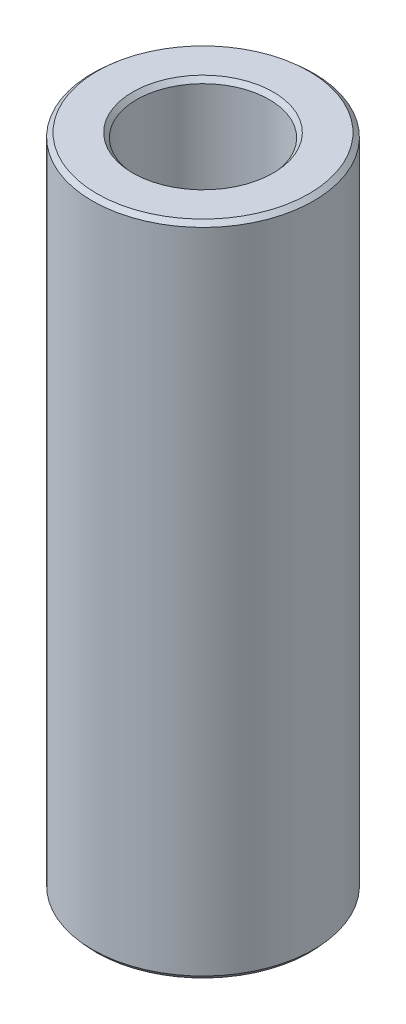
ISO-10303-21;
HEADER;
FILE_DESCRIPTION(('STEP AP214'),'2;1');
FILE_NAME('part.step','',(''),(''),'','','');
FILE_SCHEMA(('AUTOMOTIVE_DESIGN { 1 0 10303 214 1 1 1 1 }'));
ENDSEC;
DATA;
#1=APPLICATION_CONTEXT('core data for automotive mechanical design processes');
#2=APPLICATION_PROTOCOL_DEFINITION('international standard','automotive_design',2000,#1);
#3=PRODUCT_CONTEXT('',#1,'mechanical');
#4=PRODUCT('Part','Part','',(#3));
#5=PRODUCT_RELATED_PRODUCT_CATEGORY('part','',(#4));
#6=PRODUCT_DEFINITION_FORMATION('','',#4);
#7=PRODUCT_DEFINITION_CONTEXT('part definition',#1,'design');
#8=PRODUCT_DEFINITION('design','',#6,#7);
#9=PRODUCT_DEFINITION_SHAPE('','',#8);
#10=(LENGTH_UNIT() NAMED_UNIT(*) SI_UNIT(.MILLI.,.METRE.));
#11=(NAMED_UNIT(*) PLANE_ANGLE_UNIT() SI_UNIT($,.RADIAN.));
#12=(NAMED_UNIT(*) SI_UNIT($,.STERADIAN.) SOLID_ANGLE_UNIT());
#13=UNCERTAINTY_MEASURE_WITH_UNIT(LENGTH_MEASURE(1.E-05),#10,'distance_accuracy_value','');
#14=(GEOMETRIC_REPRESENTATION_CONTEXT(3) GLOBAL_UNCERTAINTY_ASSIGNED_CONTEXT((#13)) GLOBAL_UNIT_ASSIGNED_CONTEXT((#10,
#11,#12)) REPRESENTATION_CONTEXT('',''));
#15=CARTESIAN_POINT('',(0.,0.,0.));
#16=DIRECTION('',(0.,0.,1.));
#17=DIRECTION('',(1.,0.,0.));
#18=AXIS2_PLACEMENT_3D('',#15,#16,#17);
#19=CARTESIAN_POINT('',(0.,222.663709107009,0.));
#20=DIRECTION('',(0.,-1.,0.));
#21=DIRECTION('',(0.,0.,-1.));
#22=AXIS2_PLACEMENT_3D('',#19,#20,#21);
#23=CYLINDRICAL_SURFACE('',#22,37.5);
#24=CARTESIAN_POINT('',(0.,1.54506630797216,0.));
#25=DIRECTION('',(0.,1.,0.));
#26=DIRECTION('',(0.,0.,1.));
#27=AXIS2_PLACEMENT_3D('',#24,#25,#26);
#28=CIRCLE('',#27,37.5);
#29=CARTESIAN_POINT('',(0.,1.54506630797216,37.5));
#30=VERTEX_POINT('',#29);
#31=EDGE_CURVE('E10',#30,#30,#28,.T.);
#32=ORIENTED_EDGE('',*,*,#31,.T.);
#33=EDGE_LOOP('',(#32));
#34=FACE_BOUND('',#33,.T.);
#35=CARTESIAN_POINT('',(0.,221.30656046984,0.));
#36=DIRECTION('',(0.,1.,0.));
#37=DIRECTION('',(0.,0.,1.));
#38=AXIS2_PLACEMENT_3D('',#35,#36,#37);
#39=CIRCLE('',#38,37.5);
#40=CARTESIAN_POINT('',(0.,221.30656046984,37.5));
#41=VERTEX_POINT('',#40);
#42=EDGE_CURVE('E50',#41,#41,#39,.F.);
#43=ORIENTED_EDGE('',*,*,#42,.T.);
#44=EDGE_LOOP('',(#43));
#45=FACE_BOUND('',#44,.T.);
#46=ADVANCED_FACE('F39',(#34,#45),#23,.T.);
#47=CARTESIAN_POINT('',(0.,222.663709107009,0.));
#48=DIRECTION('',(0.,1.,0.));
#49=DIRECTION('',(0.,0.,1.));
#50=AXIS2_PLACEMENT_3D('',#47,#48,#49);
#51=PLANE('',#50);
#52=CARTESIAN_POINT('',(0.,222.663709107009,0.));
#53=DIRECTION('',(0.,1.,0.));
#54=DIRECTION('',(0.,0.,1.));
#55=AXIS2_PLACEMENT_3D('',#52,#53,#54);
#56=CIRCLE('',#55,23.8172264737195);
#57=CARTESIAN_POINT('',(0.,222.663709107009,23.8172264737195));
#58=VERTEX_POINT('',#57);
#59=EDGE_CURVE('E58',#58,#58,#56,.F.);
#60=ORIENTED_EDGE('',*,*,#59,.T.);
#61=EDGE_LOOP('',(#60));
#62=FACE_BOUND('',#61,.T.);
#63=CARTESIAN_POINT('',(0.,222.663709107009,0.));
#64=DIRECTION('',(0.,1.,0.));
#65=DIRECTION('',(0.,0.,1.));
#66=AXIS2_PLACEMENT_3D('',#63,#64,#65);
#67=CIRCLE('',#66,35.9549336920279);
#68=CARTESIAN_POINT('',(0.,222.663709107009,35.9549336920279));
#69=VERTEX_POINT('',#68);
#70=EDGE_CURVE('E61',#69,#69,#67,.T.);
#71=ORIENTED_EDGE('',*,*,#70,.T.);
#72=EDGE_LOOP('',(#71));
#73=FACE_BOUND('',#72,.T.);
#74=ADVANCED_FACE('F88',(#62,#73),#51,.T.);
#75=CARTESIAN_POINT('',(0.,0.,0.));
#76=DIRECTION('',(0.,1.,0.));
#77=DIRECTION('',(0.,0.,1.));
#78=AXIS2_PLACEMENT_3D('',#75,#76,#77);
#79=PLANE('',#78);
#80=CARTESIAN_POINT('',(0.,0.,0.));
#81=DIRECTION('',(0.,1.,0.));
#82=DIRECTION('',(0.,0.,1.));
#83=AXIS2_PLACEMENT_3D('',#80,#81,#82);
#84=CIRCLE('',#83,24.0051441445224);
#85=CARTESIAN_POINT('',(0.,0.,24.0051441445224));
#86=VERTEX_POINT('',#85);
#87=EDGE_CURVE('E51',#86,#86,#84,.T.);
#88=ORIENTED_EDGE('',*,*,#87,.T.);
#89=EDGE_LOOP('',(#88));
#90=FACE_BOUND('',#89,.T.);
#91=CARTESIAN_POINT('',(0.,0.,0.));
#92=DIRECTION('',(0.,1.,0.));
#93=DIRECTION('',(0.,0.,1.));
#94=AXIS2_PLACEMENT_3D('',#91,#92,#93);
#95=CIRCLE('',#94,36.1428513628309);
#96=CARTESIAN_POINT('',(0.,0.,36.1428513628309));
#97=VERTEX_POINT('',#96);
#98=EDGE_CURVE('E54',#97,#97,#95,.F.);
#99=ORIENTED_EDGE('',*,*,#98,.T.);
#100=EDGE_LOOP('',(#99));
#101=FACE_BOUND('',#100,.T.);
#102=ADVANCED_FACE('F83',(#90,#101),#79,.F.);
#103=CARTESIAN_POINT('',(0.,222.663709107009,0.));
#104=DIRECTION('',(0.,-1.,0.));
#105=DIRECTION('',(0.,0.,-1.));
#106=AXIS2_PLACEMENT_3D('',#103,#104,#105);
#107=CYLINDRICAL_SURFACE('',#106,22.4600778365503);
#108=CARTESIAN_POINT('',(0.,221.118642799037,0.));
#109=DIRECTION('',(0.,1.,0.));
#110=DIRECTION('',(0.,0.,1.));
#111=AXIS2_PLACEMENT_3D('',#108,#109,#110);
#112=CIRCLE('',#111,22.4600778365503);
#113=CARTESIAN_POINT('',(0.,221.118642799037,22.4600778365503));
#114=VERTEX_POINT('',#113);
#115=EDGE_CURVE('E67',#114,#114,#112,.T.);
#116=ORIENTED_EDGE('',*,*,#115,.T.);
#117=EDGE_LOOP('',(#116));
#118=FACE_BOUND('',#117,.T.);
#119=CARTESIAN_POINT('',(0.,1.3571486371691,0.));
#120=DIRECTION('',(0.,1.,0.));
#121=DIRECTION('',(0.,0.,1.));
#122=AXIS2_PLACEMENT_3D('',#119,#120,#121);
#123=CIRCLE('',#122,22.4600778365503);
#124=CARTESIAN_POINT('',(0.,1.3571486371691,22.4600778365503));
#125=VERTEX_POINT('',#124);
#126=EDGE_CURVE('E69',#125,#125,#123,.F.);
#127=ORIENTED_EDGE('',*,*,#126,.T.);
#128=EDGE_LOOP('',(#127));
#129=FACE_BOUND('',#128,.T.);
#130=ADVANCED_FACE('F71',(#118,#129),#107,.F.);
#131=CARTESIAN_POINT('',(0.,221.118642799037,0.));
#132=DIRECTION('',(0.,1.,0.));
#133=DIRECTION('',(0.,0.,1.));
#134=AXIS2_PLACEMENT_3D('',#131,#132,#133);
#135=CONICAL_SURFACE('',#134,22.4600778365503,0.720738682200155);
#136=ORIENTED_EDGE('',*,*,#59,.F.);
#137=EDGE_LOOP('',(#136));
#138=FACE_BOUND('',#137,.T.);
#139=ORIENTED_EDGE('',*,*,#115,.F.);
#140=EDGE_LOOP('',(#139));
#141=FACE_BOUND('',#140,.T.);
#142=ADVANCED_FACE('F77',(#138,#141),#135,.F.);
#143=CARTESIAN_POINT('',(0.,0.,0.));
#144=DIRECTION('',(0.,-1.,0.));
#145=DIRECTION('',(0.,0.,-1.));
#146=AXIS2_PLACEMENT_3D('',#143,#144,#145);
#147=CONICAL_SURFACE('',#146,24.0051441445224,0.850057644594747);
#148=ORIENTED_EDGE('',*,*,#126,.F.);
#149=EDGE_LOOP('',(#148));
#150=FACE_BOUND('',#149,.T.);
#151=ORIENTED_EDGE('',*,*,#87,.F.);
#152=EDGE_LOOP('',(#151));
#153=FACE_BOUND('',#152,.T.);
#154=ADVANCED_FACE('F73',(#150,#153),#147,.F.);
#155=CARTESIAN_POINT('',(0.,1.54506630797216,0.));
#156=DIRECTION('',(0.,1.,0.));
#157=DIRECTION('',(0.,0.,1.));
#158=AXIS2_PLACEMENT_3D('',#155,#156,#157);
#159=CONICAL_SURFACE('',#158,37.5,0.720738682200138);
#160=ORIENTED_EDGE('',*,*,#98,.F.);
#161=EDGE_LOOP('',(#160));
#162=FACE_BOUND('',#161,.T.);
#163=ORIENTED_EDGE('',*,*,#31,.F.);
#164=EDGE_LOOP('',(#163));
#165=FACE_BOUND('',#164,.T.);
#166=ADVANCED_FACE('F76',(#162,#165),#159,.T.);
#167=CARTESIAN_POINT('',(0.,222.663709107009,0.));
#168=DIRECTION('',(0.,-1.,0.));
#169=DIRECTION('',(0.,0.,-1.));
#170=AXIS2_PLACEMENT_3D('',#167,#168,#169);
#171=CONICAL_SURFACE('',#170,35.9549336920279,0.850057644594751);
#172=ORIENTED_EDGE('',*,*,#42,.F.);
#173=EDGE_LOOP('',(#172));
#174=FACE_BOUND('',#173,.T.);
#175=ORIENTED_EDGE('',*,*,#70,.F.);
#176=EDGE_LOOP('',(#175));
#177=FACE_BOUND('',#176,.T.);
#178=ADVANCED_FACE('F45',(#174,#177),#171,.T.);
#179=CLOSED_SHELL('',(#46,#74,#102,#130,#142,#154,#166,#178));
#180=MANIFOLD_SOLID_BREP('B2',#179);
#181=ADVANCED_BREP_SHAPE_REPRESENTATION('',(#18,#180),#14);
#182=SHAPE_DEFINITION_REPRESENTATION(#9,#181);
ENDSEC;
END-ISO-10303-21;
